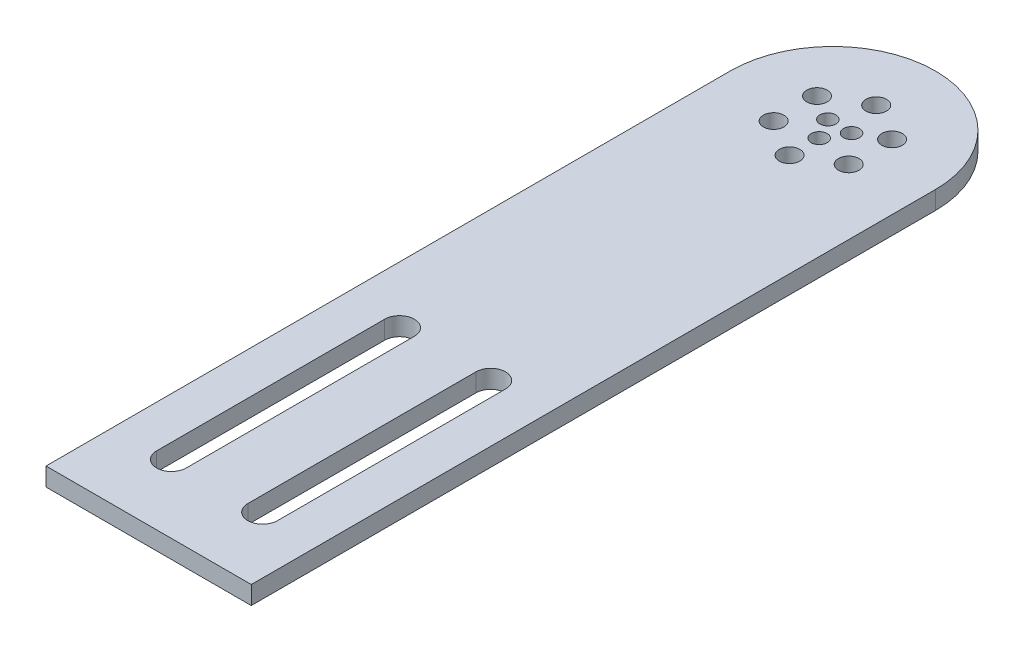
ISO-10303-21;
HEADER;
FILE_DESCRIPTION(('STEP AP214'),'2;1');
FILE_NAME('part.step','',(''),(''),'','','');
FILE_SCHEMA(('AUTOMOTIVE_DESIGN { 1 0 10303 214 1 1 1 1 }'));
ENDSEC;
DATA;
#1=APPLICATION_CONTEXT('core data for automotive mechanical design processes');
#2=APPLICATION_PROTOCOL_DEFINITION('international standard','automotive_design',2000,#1);
#3=PRODUCT_CONTEXT('',#1,'mechanical');
#4=PRODUCT('Part','Part','',(#3));
#5=PRODUCT_RELATED_PRODUCT_CATEGORY('part','',(#4));
#6=PRODUCT_DEFINITION_FORMATION('','',#4);
#7=PRODUCT_DEFINITION_CONTEXT('part definition',#1,'design');
#8=PRODUCT_DEFINITION('design','',#6,#7);
#9=PRODUCT_DEFINITION_SHAPE('','',#8);
#10=(LENGTH_UNIT() NAMED_UNIT(*) SI_UNIT(.MILLI.,.METRE.));
#11=(NAMED_UNIT(*) PLANE_ANGLE_UNIT() SI_UNIT($,.RADIAN.));
#12=(NAMED_UNIT(*) SI_UNIT($,.STERADIAN.) SOLID_ANGLE_UNIT());
#13=UNCERTAINTY_MEASURE_WITH_UNIT(LENGTH_MEASURE(1.E-05),#10,'distance_accuracy_value','');
#14=(GEOMETRIC_REPRESENTATION_CONTEXT(3) GLOBAL_UNCERTAINTY_ASSIGNED_CONTEXT((#13)) GLOBAL_UNIT_ASSIGNED_CONTEXT((#10,
#11,#12)) REPRESENTATION_CONTEXT('',''));
#15=CARTESIAN_POINT('',(0.,0.,0.));
#16=DIRECTION('',(0.,0.,1.));
#17=DIRECTION('',(1.,0.,0.));
#18=AXIS2_PLACEMENT_3D('',#15,#16,#17);
#19=CARTESIAN_POINT('',(0.,4.,0.));
#20=DIRECTION('',(0.,1.,0.));
#21=DIRECTION('',(0.,0.,1.));
#22=AXIS2_PLACEMENT_3D('',#19,#20,#21);
#23=PLANE('',#22);
#24=CARTESIAN_POINT('',(-9.99999999999999,4.,9.99999999999999));
#25=DIRECTION('',(0.,1.,0.));
#26=DIRECTION('',(0.,0.,1.));
#27=AXIS2_PLACEMENT_3D('',#24,#25,#26);
#28=CIRCLE('',#27,3.25);
#29=CARTESIAN_POINT('',(-6.74999999999999,4.,9.99999999999999));
#30=VERTEX_POINT('',#29);
#31=CARTESIAN_POINT('',(-13.25,4.,9.99999999999999));
#32=VERTEX_POINT('',#31);
#33=EDGE_CURVE('E151',#30,#32,#28,.T.);
#34=ORIENTED_EDGE('',*,*,#33,.F.);
#35=DIRECTION('',(0.,0.,-1.));
#36=VECTOR('',#35,1.);
#37=CARTESIAN_POINT('',(-6.74999999999999,4.,9.99999999999999));
#38=LINE('',#37,#36);
#39=CARTESIAN_POINT('',(-6.74999999999998,4.,60.));
#40=VERTEX_POINT('',#39);
#41=EDGE_CURVE('E159',#40,#30,#38,.T.);
#42=ORIENTED_EDGE('',*,*,#41,.F.);
#43=CARTESIAN_POINT('',(-9.99999999999998,4.,60.));
#44=DIRECTION('',(0.,1.,0.));
#45=DIRECTION('',(0.,0.,1.));
#46=AXIS2_PLACEMENT_3D('',#43,#44,#45);
#47=CIRCLE('',#46,3.25);
#48=CARTESIAN_POINT('',(-13.25,4.,60.));
#49=VERTEX_POINT('',#48);
#50=EDGE_CURVE('E173',#49,#40,#47,.T.);
#51=ORIENTED_EDGE('',*,*,#50,.F.);
#52=DIRECTION('',(0.,0.,1.));
#53=VECTOR('',#52,1.);
#54=CARTESIAN_POINT('',(-13.25,4.,9.99999999999999));
#55=LINE('',#54,#53);
#56=EDGE_CURVE('E170',#32,#49,#55,.T.);
#57=ORIENTED_EDGE('',*,*,#56,.F.);
#58=EDGE_LOOP('',(#34,#42,#51,#57));
#59=FACE_BOUND('',#58,.T.);
#60=CARTESIAN_POINT('',(-2.5980762113533,4.,-76.5));
#61=DIRECTION('',(0.,1.,0.));
#62=DIRECTION('',(-0.866025403784436,0.,-0.500000000000004));
#63=AXIS2_PLACEMENT_3D('',#60,#61,#62);
#64=CIRCLE('',#63,1.75);
#65=CARTESIAN_POINT('',(-4.11362066797607,4.,-77.375));
#66=VERTEX_POINT('',#65);
#67=EDGE_CURVE('E191',#66,#66,#64,.T.);
#68=ORIENTED_EDGE('',*,*,#67,.F.);
#69=EDGE_LOOP('',(#68));
#70=FACE_BOUND('',#69,.T.);
#71=CARTESIAN_POINT('',(2.59807621135334,4.,-76.5));
#72=DIRECTION('',(0.,1.,0.));
#73=DIRECTION('',(0.866025403784443,0.,-0.499999999999992));
#74=AXIS2_PLACEMENT_3D('',#71,#72,#73);
#75=CIRCLE('',#74,1.75);
#76=CARTESIAN_POINT('',(4.11362066797612,4.,-77.3749999999999));
#77=VERTEX_POINT('',#76);
#78=EDGE_CURVE('E180',#77,#77,#75,.T.);
#79=ORIENTED_EDGE('',*,*,#78,.F.);
#80=EDGE_LOOP('',(#79));
#81=FACE_BOUND('',#80,.T.);
#82=CARTESIAN_POINT('',(0.,4.,-72.));
#83=DIRECTION('',(0.,1.,0.));
#84=DIRECTION('',(0.,0.,1.));
#85=AXIS2_PLACEMENT_3D('',#82,#83,#84);
#86=CIRCLE('',#85,1.75);
#87=CARTESIAN_POINT('',(0.,4.,-70.25));
#88=VERTEX_POINT('',#87);
#89=EDGE_CURVE('E190',#88,#88,#86,.T.);
#90=ORIENTED_EDGE('',*,*,#89,.F.);
#91=EDGE_LOOP('',(#90));
#92=FACE_BOUND('',#91,.T.);
#93=CARTESIAN_POINT('',(8.22724133595212,4.,-79.7500000000001));
#94=DIRECTION('',(0.,1.,0.));
#95=DIRECTION('',(-0.866025403784433,0.,0.50000000000001));
#96=AXIS2_PLACEMENT_3D('',#93,#94,#95);
#97=CIRCLE('',#96,2.25);
#98=CARTESIAN_POINT('',(6.27868417743715,4.,-78.6250000000001));
#99=VERTEX_POINT('',#98);
#100=EDGE_CURVE('E202',#99,#99,#97,.T.);
#101=ORIENTED_EDGE('',*,*,#100,.F.);
#102=EDGE_LOOP('',(#101));
#103=FACE_BOUND('',#102,.T.);
#104=CARTESIAN_POINT('',(8.22724133595222,4.,-70.2500000000001));
#105=DIRECTION('',(0.,1.,0.));
#106=DIRECTION('',(-0.866025403784443,0.,-0.499999999999992));
#107=AXIS2_PLACEMENT_3D('',#104,#105,#106);
#108=CIRCLE('',#107,2.25);
#109=CARTESIAN_POINT('',(6.27868417743722,4.,-71.3750000000001));
#110=VERTEX_POINT('',#109);
#111=EDGE_CURVE('E221',#110,#110,#108,.T.);
#112=ORIENTED_EDGE('',*,*,#111,.F.);
#113=EDGE_LOOP('',(#112));
#114=FACE_BOUND('',#113,.T.);
#115=CARTESIAN_POINT('',(0.,4.,-65.5));
#116=DIRECTION('',(0.,1.,0.));
#117=DIRECTION('',(0.,0.,-1.));
#118=AXIS2_PLACEMENT_3D('',#115,#116,#117);
#119=CIRCLE('',#118,2.25);
#120=CARTESIAN_POINT('',(0.,4.,-67.75));
#121=VERTEX_POINT('',#120);
#122=EDGE_CURVE('E215',#121,#121,#119,.T.);
#123=ORIENTED_EDGE('',*,*,#122,.F.);
#124=EDGE_LOOP('',(#123));
#125=FACE_BOUND('',#124,.T.);
#126=CARTESIAN_POINT('',(-8.22724133595212,4.,-70.25));
#127=DIRECTION('',(0.,1.,0.));
#128=DIRECTION('',(0.866025403784436,0.,-0.500000000000004));
#129=AXIS2_PLACEMENT_3D('',#126,#127,#128);
#130=CIRCLE('',#129,2.25);
#131=CARTESIAN_POINT('',(-6.27868417743714,4.,-71.375));
#132=VERTEX_POINT('',#131);
#133=EDGE_CURVE('E209',#132,#132,#130,.T.);
#134=ORIENTED_EDGE('',*,*,#133,.F.);
#135=EDGE_LOOP('',(#134));
#136=FACE_BOUND('',#135,.T.);
#137=CARTESIAN_POINT('',(-8.22724133595215,4.,-79.75));
#138=DIRECTION('',(0.,1.,0.));
#139=DIRECTION('',(0.86602540378444,0.,0.499999999999998));
#140=AXIS2_PLACEMENT_3D('',#137,#138,#139);
#141=CIRCLE('',#140,2.25);
#142=CARTESIAN_POINT('',(-6.27868417743716,4.,-78.625));
#143=VERTEX_POINT('',#142);
#144=EDGE_CURVE('E208',#143,#143,#141,.T.);
#145=ORIENTED_EDGE('',*,*,#144,.F.);
#146=EDGE_LOOP('',(#145));
#147=FACE_BOUND('',#146,.T.);
#148=CARTESIAN_POINT('',(0.,4.,-84.5));
#149=DIRECTION('',(0.,1.,0.));
#150=DIRECTION('',(0.,0.,1.));
#151=AXIS2_PLACEMENT_3D('',#148,#149,#150);
#152=CIRCLE('',#151,2.25);
#153=CARTESIAN_POINT('',(0.,4.,-82.25));
#154=VERTEX_POINT('',#153);
#155=EDGE_CURVE('E232',#154,#154,#152,.T.);
#156=ORIENTED_EDGE('',*,*,#155,.F.);
#157=EDGE_LOOP('',(#156));
#158=FACE_BOUND('',#157,.T.);
#159=DIRECTION('',(0.,0.,-1.));
#160=VECTOR('',#159,1.);
#161=CARTESIAN_POINT('',(22.5,4.,-75.));
#162=LINE('',#161,#160);
#163=CARTESIAN_POINT('',(22.5,4.,75.));
#164=VERTEX_POINT('',#163);
#165=CARTESIAN_POINT('',(22.5,4.,-75.));
#166=VERTEX_POINT('',#165);
#167=EDGE_CURVE('E246',#164,#166,#162,.T.);
#168=ORIENTED_EDGE('',*,*,#167,.T.);
#169=CARTESIAN_POINT('',(0.,4.,-75.));
#170=DIRECTION('',(0.,1.,0.));
#171=DIRECTION('',(0.,0.,1.));
#172=AXIS2_PLACEMENT_3D('',#169,#170,#171);
#173=CIRCLE('',#172,22.5);
#174=CARTESIAN_POINT('',(-22.5,4.,-75.));
#175=VERTEX_POINT('',#174);
#176=EDGE_CURVE('E241',#166,#175,#173,.T.);
#177=ORIENTED_EDGE('',*,*,#176,.T.);
#178=DIRECTION('',(0.,0.,1.));
#179=VECTOR('',#178,1.);
#180=CARTESIAN_POINT('',(-22.5,4.,-75.));
#181=LINE('',#180,#179);
#182=CARTESIAN_POINT('',(-22.5,4.,75.));
#183=VERTEX_POINT('',#182);
#184=EDGE_CURVE('E249',#175,#183,#181,.T.);
#185=ORIENTED_EDGE('',*,*,#184,.T.);
#186=DIRECTION('',(1.,0.,0.));
#187=VECTOR('',#186,1.);
#188=CARTESIAN_POINT('',(-22.5,4.,75.));
#189=LINE('',#188,#187);
#190=EDGE_CURVE('E252',#183,#164,#189,.T.);
#191=ORIENTED_EDGE('',*,*,#190,.T.);
#192=EDGE_LOOP('',(#168,#177,#185,#191));
#193=FACE_BOUND('',#192,.T.);
#194=DIRECTION('',(0.,0.,-1.));
#195=VECTOR('',#194,1.);
#196=CARTESIAN_POINT('',(6.74999999999999,4.,9.99999999999999));
#197=LINE('',#196,#195);
#198=CARTESIAN_POINT('',(6.74999999999998,4.,60.));
#199=VERTEX_POINT('',#198);
#200=CARTESIAN_POINT('',(6.74999999999999,4.,9.99999999999999));
#201=VERTEX_POINT('',#200);
#202=EDGE_CURVE('E145',#199,#201,#197,.T.);
#203=ORIENTED_EDGE('',*,*,#202,.T.);
#204=CARTESIAN_POINT('',(9.99999999999999,4.,9.99999999999999));
#205=DIRECTION('',(0.,-1.,0.));
#206=DIRECTION('',(0.,0.,1.));
#207=AXIS2_PLACEMENT_3D('',#204,#205,#206);
#208=CIRCLE('',#207,3.25);
#209=CARTESIAN_POINT('',(13.25,4.,9.99999999999999));
#210=VERTEX_POINT('',#209);
#211=EDGE_CURVE('E47',#201,#210,#208,.T.);
#212=ORIENTED_EDGE('',*,*,#211,.T.);
#213=DIRECTION('',(0.,0.,1.));
#214=VECTOR('',#213,1.);
#215=CARTESIAN_POINT('',(13.25,4.,9.99999999999999));
#216=LINE('',#215,#214);
#217=CARTESIAN_POINT('',(13.25,4.,60.));
#218=VERTEX_POINT('',#217);
#219=EDGE_CURVE('E136',#210,#218,#216,.T.);
#220=ORIENTED_EDGE('',*,*,#219,.T.);
#221=CARTESIAN_POINT('',(9.99999999999998,4.,60.));
#222=DIRECTION('',(0.,-1.,0.));
#223=DIRECTION('',(0.,0.,1.));
#224=AXIS2_PLACEMENT_3D('',#221,#222,#223);
#225=CIRCLE('',#224,3.25);
#226=EDGE_CURVE('E139',#218,#199,#225,.T.);
#227=ORIENTED_EDGE('',*,*,#226,.T.);
#228=EDGE_LOOP('',(#203,#212,#220,#227));
#229=FACE_BOUND('',#228,.T.);
#230=ADVANCED_FACE('F32',(#59,#70,#81,#92,#103,#114,#125,#136,#147,#158,#193,#229),#23,.T.);
#231=CARTESIAN_POINT('',(0.,0.,0.));
#232=DIRECTION('',(0.,1.,0.));
#233=DIRECTION('',(0.,0.,1.));
#234=AXIS2_PLACEMENT_3D('',#231,#232,#233);
#235=PLANE('',#234);
#236=DIRECTION('',(0.,0.,1.));
#237=VECTOR('',#236,1.);
#238=CARTESIAN_POINT('',(-22.5,0.,-75.));
#239=LINE('',#238,#237);
#240=CARTESIAN_POINT('',(-22.5,0.,-75.));
#241=VERTEX_POINT('',#240);
#242=CARTESIAN_POINT('',(-22.5,0.,75.));
#243=VERTEX_POINT('',#242);
#244=EDGE_CURVE('E257',#241,#243,#239,.T.);
#245=ORIENTED_EDGE('',*,*,#244,.F.);
#246=CARTESIAN_POINT('',(0.,0.,-75.));
#247=DIRECTION('',(0.,1.,0.));
#248=DIRECTION('',(0.,0.,1.));
#249=AXIS2_PLACEMENT_3D('',#246,#247,#248);
#250=CIRCLE('',#249,22.5);
#251=CARTESIAN_POINT('',(22.5,0.,-75.));
#252=VERTEX_POINT('',#251);
#253=EDGE_CURVE('E238',#252,#241,#250,.T.);
#254=ORIENTED_EDGE('',*,*,#253,.F.);
#255=DIRECTION('',(0.,0.,-1.));
#256=VECTOR('',#255,1.);
#257=CARTESIAN_POINT('',(22.5,0.,-75.));
#258=LINE('',#257,#256);
#259=CARTESIAN_POINT('',(22.5,0.,75.));
#260=VERTEX_POINT('',#259);
#261=EDGE_CURVE('E244',#260,#252,#258,.T.);
#262=ORIENTED_EDGE('',*,*,#261,.F.);
#263=DIRECTION('',(1.,0.,0.));
#264=VECTOR('',#263,1.);
#265=CARTESIAN_POINT('',(-22.5,0.,75.));
#266=LINE('',#265,#264);
#267=EDGE_CURVE('E250',#243,#260,#266,.T.);
#268=ORIENTED_EDGE('',*,*,#267,.F.);
#269=EDGE_LOOP('',(#245,#254,#262,#268));
#270=FACE_BOUND('',#269,.T.);
#271=CARTESIAN_POINT('',(0.,0.,-84.5));
#272=DIRECTION('',(0.,1.,0.));
#273=DIRECTION('',(0.,0.,1.));
#274=AXIS2_PLACEMENT_3D('',#271,#272,#273);
#275=CIRCLE('',#274,2.25);
#276=CARTESIAN_POINT('',(0.,0.,-82.25));
#277=VERTEX_POINT('',#276);
#278=EDGE_CURVE('E235',#277,#277,#275,.T.);
#279=ORIENTED_EDGE('',*,*,#278,.T.);
#280=EDGE_LOOP('',(#279));
#281=FACE_BOUND('',#280,.T.);
#282=CARTESIAN_POINT('',(-8.22724133595215,0.,-79.75));
#283=DIRECTION('',(0.,1.,0.));
#284=DIRECTION('',(0.86602540378444,0.,0.499999999999998));
#285=AXIS2_PLACEMENT_3D('',#282,#283,#284);
#286=CIRCLE('',#285,2.25);
#287=CARTESIAN_POINT('',(-6.27868417743716,0.,-78.625));
#288=VERTEX_POINT('',#287);
#289=EDGE_CURVE('E229',#288,#288,#286,.T.);
#290=ORIENTED_EDGE('',*,*,#289,.T.);
#291=EDGE_LOOP('',(#290));
#292=FACE_BOUND('',#291,.T.);
#293=CARTESIAN_POINT('',(-8.22724133595212,0.,-70.25));
#294=DIRECTION('',(0.,1.,0.));
#295=DIRECTION('',(0.866025403784436,0.,-0.500000000000004));
#296=AXIS2_PLACEMENT_3D('',#293,#294,#295);
#297=CIRCLE('',#296,2.25);
#298=CARTESIAN_POINT('',(-6.27868417743714,0.,-71.375));
#299=VERTEX_POINT('',#298);
#300=EDGE_CURVE('E205',#299,#299,#297,.T.);
#301=ORIENTED_EDGE('',*,*,#300,.T.);
#302=EDGE_LOOP('',(#301));
#303=FACE_BOUND('',#302,.T.);
#304=CARTESIAN_POINT('',(0.,0.,-65.5));
#305=DIRECTION('',(0.,1.,0.));
#306=DIRECTION('',(0.,0.,-1.));
#307=AXIS2_PLACEMENT_3D('',#304,#305,#306);
#308=CIRCLE('',#307,2.25);
#309=CARTESIAN_POINT('',(0.,0.,-67.75));
#310=VERTEX_POINT('',#309);
#311=EDGE_CURVE('E212',#310,#310,#308,.T.);
#312=ORIENTED_EDGE('',*,*,#311,.T.);
#313=EDGE_LOOP('',(#312));
#314=FACE_BOUND('',#313,.T.);
#315=CARTESIAN_POINT('',(8.22724133595222,0.,-70.2500000000001));
#316=DIRECTION('',(0.,1.,0.));
#317=DIRECTION('',(-0.866025403784443,0.,-0.499999999999992));
#318=AXIS2_PLACEMENT_3D('',#315,#316,#317);
#319=CIRCLE('',#318,2.25);
#320=CARTESIAN_POINT('',(6.27868417743722,0.,-71.3750000000001));
#321=VERTEX_POINT('',#320);
#322=EDGE_CURVE('E218',#321,#321,#319,.T.);
#323=ORIENTED_EDGE('',*,*,#322,.T.);
#324=EDGE_LOOP('',(#323));
#325=FACE_BOUND('',#324,.T.);
#326=CARTESIAN_POINT('',(8.22724133595212,0.,-79.7500000000001));
#327=DIRECTION('',(0.,1.,0.));
#328=DIRECTION('',(-0.866025403784433,0.,0.50000000000001));
#329=AXIS2_PLACEMENT_3D('',#326,#327,#328);
#330=CIRCLE('',#329,2.25);
#331=CARTESIAN_POINT('',(6.27868417743715,0.,-78.6250000000001));
#332=VERTEX_POINT('',#331);
#333=EDGE_CURVE('E224',#332,#332,#330,.T.);
#334=ORIENTED_EDGE('',*,*,#333,.T.);
#335=EDGE_LOOP('',(#334));
#336=FACE_BOUND('',#335,.T.);
#337=CARTESIAN_POINT('',(0.,0.,-72.));
#338=DIRECTION('',(0.,1.,0.));
#339=DIRECTION('',(0.,0.,1.));
#340=AXIS2_PLACEMENT_3D('',#337,#338,#339);
#341=CIRCLE('',#340,1.75);
#342=CARTESIAN_POINT('',(0.,0.,-70.25));
#343=VERTEX_POINT('',#342);
#344=EDGE_CURVE('E199',#343,#343,#341,.T.);
#345=ORIENTED_EDGE('',*,*,#344,.T.);
#346=EDGE_LOOP('',(#345));
#347=FACE_BOUND('',#346,.T.);
#348=CARTESIAN_POINT('',(2.59807621135334,0.,-76.5));
#349=DIRECTION('',(0.,1.,0.));
#350=DIRECTION('',(0.866025403784443,0.,-0.499999999999992));
#351=AXIS2_PLACEMENT_3D('',#348,#349,#350);
#352=CIRCLE('',#351,1.75);
#353=CARTESIAN_POINT('',(4.11362066797612,0.,-77.3749999999999));
#354=VERTEX_POINT('',#353);
#355=EDGE_CURVE('E194',#354,#354,#352,.T.);
#356=ORIENTED_EDGE('',*,*,#355,.T.);
#357=EDGE_LOOP('',(#356));
#358=FACE_BOUND('',#357,.T.);
#359=CARTESIAN_POINT('',(-2.5980762113533,0.,-76.5));
#360=DIRECTION('',(0.,1.,0.));
#361=DIRECTION('',(-0.866025403784436,0.,-0.500000000000004));
#362=AXIS2_PLACEMENT_3D('',#359,#360,#361);
#363=CIRCLE('',#362,1.75);
#364=CARTESIAN_POINT('',(-4.11362066797607,0.,-77.375));
#365=VERTEX_POINT('',#364);
#366=EDGE_CURVE('E187',#365,#365,#363,.T.);
#367=ORIENTED_EDGE('',*,*,#366,.T.);
#368=EDGE_LOOP('',(#367));
#369=FACE_BOUND('',#368,.T.);
#370=DIRECTION('',(0.,0.,-1.));
#371=VECTOR('',#370,1.);
#372=CARTESIAN_POINT('',(-6.74999999999999,0.,9.99999999999999));
#373=LINE('',#372,#371);
#374=CARTESIAN_POINT('',(-6.74999999999998,0.,60.));
#375=VERTEX_POINT('',#374);
#376=CARTESIAN_POINT('',(-6.74999999999999,0.,9.99999999999999));
#377=VERTEX_POINT('',#376);
#378=EDGE_CURVE('E165',#375,#377,#373,.T.);
#379=ORIENTED_EDGE('',*,*,#378,.T.);
#380=CARTESIAN_POINT('',(-9.99999999999999,0.,9.99999999999999));
#381=DIRECTION('',(0.,1.,0.));
#382=DIRECTION('',(0.,0.,1.));
#383=AXIS2_PLACEMENT_3D('',#380,#381,#382);
#384=CIRCLE('',#383,3.25);
#385=CARTESIAN_POINT('',(-13.25,0.,9.99999999999999));
#386=VERTEX_POINT('',#385);
#387=EDGE_CURVE('E155',#377,#386,#384,.T.);
#388=ORIENTED_EDGE('',*,*,#387,.T.);
#389=DIRECTION('',(0.,0.,1.));
#390=VECTOR('',#389,1.);
#391=CARTESIAN_POINT('',(-13.25,0.,9.99999999999999));
#392=LINE('',#391,#390);
#393=CARTESIAN_POINT('',(-13.25,0.,60.));
#394=VERTEX_POINT('',#393);
#395=EDGE_CURVE('E158',#386,#394,#392,.T.);
#396=ORIENTED_EDGE('',*,*,#395,.T.);
#397=CARTESIAN_POINT('',(-9.99999999999998,0.,60.));
#398=DIRECTION('',(0.,1.,0.));
#399=DIRECTION('',(0.,0.,1.));
#400=AXIS2_PLACEMENT_3D('',#397,#398,#399);
#401=CIRCLE('',#400,3.25);
#402=EDGE_CURVE('E162',#394,#375,#401,.T.);
#403=ORIENTED_EDGE('',*,*,#402,.T.);
#404=EDGE_LOOP('',(#379,#388,#396,#403));
#405=FACE_BOUND('',#404,.T.);
#406=CARTESIAN_POINT('',(9.99999999999999,0.,9.99999999999999));
#407=DIRECTION('',(0.,-1.,0.));
#408=DIRECTION('',(0.,0.,1.));
#409=AXIS2_PLACEMENT_3D('',#406,#407,#408);
#410=CIRCLE('',#409,3.25);
#411=CARTESIAN_POINT('',(6.74999999999999,0.,9.99999999999999));
#412=VERTEX_POINT('',#411);
#413=CARTESIAN_POINT('',(13.25,0.,9.99999999999999));
#414=VERTEX_POINT('',#413);
#415=EDGE_CURVE('E128',#412,#414,#410,.T.);
#416=ORIENTED_EDGE('',*,*,#415,.F.);
#417=DIRECTION('',(0.,0.,-1.));
#418=VECTOR('',#417,1.);
#419=CARTESIAN_POINT('',(6.74999999999999,0.,9.99999999999999));
#420=LINE('',#419,#418);
#421=CARTESIAN_POINT('',(6.74999999999998,0.,60.));
#422=VERTEX_POINT('',#421);
#423=EDGE_CURVE('E120',#422,#412,#420,.T.);
#424=ORIENTED_EDGE('',*,*,#423,.F.);
#425=CARTESIAN_POINT('',(9.99999999999998,0.,60.));
#426=DIRECTION('',(0.,-1.,0.));
#427=DIRECTION('',(0.,0.,1.));
#428=AXIS2_PLACEMENT_3D('',#425,#426,#427);
#429=CIRCLE('',#428,3.25);
#430=CARTESIAN_POINT('',(13.25,0.,60.));
#431=VERTEX_POINT('',#430);
#432=EDGE_CURVE('E127',#431,#422,#429,.T.);
#433=ORIENTED_EDGE('',*,*,#432,.F.);
#434=DIRECTION('',(0.,0.,1.));
#435=VECTOR('',#434,1.);
#436=CARTESIAN_POINT('',(13.25,0.,9.99999999999999));
#437=LINE('',#436,#435);
#438=EDGE_CURVE('E132',#414,#431,#437,.T.);
#439=ORIENTED_EDGE('',*,*,#438,.F.);
#440=EDGE_LOOP('',(#416,#424,#433,#439));
#441=FACE_BOUND('',#440,.T.);
#442=ADVANCED_FACE('F135',(#270,#281,#292,#303,#314,#325,#336,#347,#358,#369,#405,#441),#235,.F.);
#443=CARTESIAN_POINT('',(22.5,4.,-75.));
#444=DIRECTION('',(-1.,0.,0.));
#445=DIRECTION('',(0.,0.,1.));
#446=AXIS2_PLACEMENT_3D('',#443,#444,#445);
#447=PLANE('',#446);
#448=ORIENTED_EDGE('',*,*,#261,.T.);
#449=DIRECTION('',(0.,-1.,0.));
#450=VECTOR('',#449,1.);
#451=CARTESIAN_POINT('',(22.5,4.,-75.));
#452=LINE('',#451,#450);
#453=EDGE_CURVE('E11',#166,#252,#452,.T.);
#454=ORIENTED_EDGE('',*,*,#453,.F.);
#455=ORIENTED_EDGE('',*,*,#167,.F.);
#456=DIRECTION('',(0.,-1.,0.));
#457=VECTOR('',#456,1.);
#458=CARTESIAN_POINT('',(22.5,4.,75.));
#459=LINE('',#458,#457);
#460=EDGE_CURVE('E254',#164,#260,#459,.T.);
#461=ORIENTED_EDGE('',*,*,#460,.T.);
#462=EDGE_LOOP('',(#448,#454,#455,#461));
#463=FACE_BOUND('',#462,.T.);
#464=ADVANCED_FACE('F34',(#463),#447,.F.);
#465=CARTESIAN_POINT('',(-22.5,4.,-75.));
#466=DIRECTION('',(1.,0.,0.));
#467=DIRECTION('',(0.,0.,-1.));
#468=AXIS2_PLACEMENT_3D('',#465,#466,#467);
#469=PLANE('',#468);
#470=ORIENTED_EDGE('',*,*,#244,.T.);
#471=DIRECTION('',(0.,-1.,0.));
#472=VECTOR('',#471,1.);
#473=CARTESIAN_POINT('',(-22.5,4.,75.));
#474=LINE('',#473,#472);
#475=EDGE_CURVE('E262',#183,#243,#474,.T.);
#476=ORIENTED_EDGE('',*,*,#475,.F.);
#477=ORIENTED_EDGE('',*,*,#184,.F.);
#478=DIRECTION('',(0.,-1.,0.));
#479=VECTOR('',#478,1.);
#480=CARTESIAN_POINT('',(-22.5,4.,-75.));
#481=LINE('',#480,#479);
#482=EDGE_CURVE('E40',#175,#241,#481,.T.);
#483=ORIENTED_EDGE('',*,*,#482,.T.);
#484=EDGE_LOOP('',(#470,#476,#477,#483));
#485=FACE_BOUND('',#484,.T.);
#486=ADVANCED_FACE('F268',(#485),#469,.F.);
#487=CARTESIAN_POINT('',(-22.5,4.,75.));
#488=DIRECTION('',(0.,0.,-1.));
#489=DIRECTION('',(-1.,0.,0.));
#490=AXIS2_PLACEMENT_3D('',#487,#488,#489);
#491=PLANE('',#490);
#492=ORIENTED_EDGE('',*,*,#267,.T.);
#493=ORIENTED_EDGE('',*,*,#460,.F.);
#494=ORIENTED_EDGE('',*,*,#190,.F.);
#495=ORIENTED_EDGE('',*,*,#475,.T.);
#496=EDGE_LOOP('',(#492,#493,#494,#495));
#497=FACE_BOUND('',#496,.T.);
#498=ADVANCED_FACE('F278',(#497),#491,.F.);
#499=CARTESIAN_POINT('',(0.,4.,-75.));
#500=DIRECTION('',(0.,-1.,0.));
#501=DIRECTION('',(0.,0.,-1.));
#502=AXIS2_PLACEMENT_3D('',#499,#500,#501);
#503=CYLINDRICAL_SURFACE('',#502,22.5);
#504=ORIENTED_EDGE('',*,*,#176,.F.);
#505=ORIENTED_EDGE('',*,*,#453,.T.);
#506=ORIENTED_EDGE('',*,*,#253,.T.);
#507=ORIENTED_EDGE('',*,*,#482,.F.);
#508=EDGE_LOOP('',(#504,#505,#506,#507));
#509=FACE_BOUND('',#508,.T.);
#510=ADVANCED_FACE('F285',(#509),#503,.T.);
#511=CARTESIAN_POINT('',(0.,0.,-84.5));
#512=DIRECTION('',(0.,1.,0.));
#513=DIRECTION('',(0.,0.,1.));
#514=AXIS2_PLACEMENT_3D('',#511,#512,#513);
#515=CYLINDRICAL_SURFACE('',#514,2.25);
#516=ORIENTED_EDGE('',*,*,#278,.F.);
#517=EDGE_LOOP('',(#516));
#518=FACE_BOUND('',#517,.T.);
#519=ORIENTED_EDGE('',*,*,#155,.T.);
#520=EDGE_LOOP('',(#519));
#521=FACE_BOUND('',#520,.T.);
#522=ADVANCED_FACE('F287',(#518,#521),#515,.F.);
#523=CARTESIAN_POINT('',(-8.22724133595215,0.,-79.75));
#524=DIRECTION('',(0.,1.,0.));
#525=DIRECTION('',(0.,0.,1.));
#526=AXIS2_PLACEMENT_3D('',#523,#524,#525);
#527=CYLINDRICAL_SURFACE('',#526,2.25);
#528=ORIENTED_EDGE('',*,*,#289,.F.);
#529=EDGE_LOOP('',(#528));
#530=FACE_BOUND('',#529,.T.);
#531=ORIENTED_EDGE('',*,*,#144,.T.);
#532=EDGE_LOOP('',(#531));
#533=FACE_BOUND('',#532,.T.);
#534=ADVANCED_FACE('F293',(#530,#533),#527,.F.);
#535=CARTESIAN_POINT('',(-8.22724133595212,0.,-70.25));
#536=DIRECTION('',(0.,1.,0.));
#537=DIRECTION('',(0.,0.,1.));
#538=AXIS2_PLACEMENT_3D('',#535,#536,#537);
#539=CYLINDRICAL_SURFACE('',#538,2.25);
#540=ORIENTED_EDGE('',*,*,#300,.F.);
#541=EDGE_LOOP('',(#540));
#542=FACE_BOUND('',#541,.T.);
#543=ORIENTED_EDGE('',*,*,#133,.T.);
#544=EDGE_LOOP('',(#543));
#545=FACE_BOUND('',#544,.T.);
#546=ADVANCED_FACE('F392',(#542,#545),#539,.F.);
#547=CARTESIAN_POINT('',(0.,0.,-65.5));
#548=DIRECTION('',(0.,1.,0.));
#549=DIRECTION('',(0.,0.,1.));
#550=AXIS2_PLACEMENT_3D('',#547,#548,#549);
#551=CYLINDRICAL_SURFACE('',#550,2.25);
#552=ORIENTED_EDGE('',*,*,#311,.F.);
#553=EDGE_LOOP('',(#552));
#554=FACE_BOUND('',#553,.T.);
#555=ORIENTED_EDGE('',*,*,#122,.T.);
#556=EDGE_LOOP('',(#555));
#557=FACE_BOUND('',#556,.T.);
#558=ADVANCED_FACE('F395',(#554,#557),#551,.F.);
#559=CARTESIAN_POINT('',(8.22724133595222,0.,-70.2500000000001));
#560=DIRECTION('',(0.,1.,0.));
#561=DIRECTION('',(0.,0.,1.));
#562=AXIS2_PLACEMENT_3D('',#559,#560,#561);
#563=CYLINDRICAL_SURFACE('',#562,2.25);
#564=ORIENTED_EDGE('',*,*,#322,.F.);
#565=EDGE_LOOP('',(#564));
#566=FACE_BOUND('',#565,.T.);
#567=ORIENTED_EDGE('',*,*,#111,.T.);
#568=EDGE_LOOP('',(#567));
#569=FACE_BOUND('',#568,.T.);
#570=ADVANCED_FACE('F399',(#566,#569),#563,.F.);
#571=CARTESIAN_POINT('',(8.22724133595212,0.,-79.7500000000001));
#572=DIRECTION('',(0.,1.,0.));
#573=DIRECTION('',(0.,0.,1.));
#574=AXIS2_PLACEMENT_3D('',#571,#572,#573);
#575=CYLINDRICAL_SURFACE('',#574,2.25);
#576=ORIENTED_EDGE('',*,*,#333,.F.);
#577=EDGE_LOOP('',(#576));
#578=FACE_BOUND('',#577,.T.);
#579=ORIENTED_EDGE('',*,*,#100,.T.);
#580=EDGE_LOOP('',(#579));
#581=FACE_BOUND('',#580,.T.);
#582=ADVANCED_FACE('F390',(#578,#581),#575,.F.);
#583=CARTESIAN_POINT('',(0.,0.,-72.));
#584=DIRECTION('',(0.,1.,0.));
#585=DIRECTION('',(0.,0.,1.));
#586=AXIS2_PLACEMENT_3D('',#583,#584,#585);
#587=CYLINDRICAL_SURFACE('',#586,1.75);
#588=ORIENTED_EDGE('',*,*,#344,.F.);
#589=EDGE_LOOP('',(#588));
#590=FACE_BOUND('',#589,.T.);
#591=ORIENTED_EDGE('',*,*,#89,.T.);
#592=EDGE_LOOP('',(#591));
#593=FACE_BOUND('',#592,.T.);
#594=ADVANCED_FACE('F386',(#590,#593),#587,.F.);
#595=CARTESIAN_POINT('',(2.59807621135334,0.,-76.5));
#596=DIRECTION('',(0.,1.,0.));
#597=DIRECTION('',(0.,0.,1.));
#598=AXIS2_PLACEMENT_3D('',#595,#596,#597);
#599=CYLINDRICAL_SURFACE('',#598,1.75);
#600=ORIENTED_EDGE('',*,*,#355,.F.);
#601=EDGE_LOOP('',(#600));
#602=FACE_BOUND('',#601,.T.);
#603=ORIENTED_EDGE('',*,*,#78,.T.);
#604=EDGE_LOOP('',(#603));
#605=FACE_BOUND('',#604,.T.);
#606=ADVANCED_FACE('F382',(#602,#605),#599,.F.);
#607=CARTESIAN_POINT('',(-2.5980762113533,0.,-76.5));
#608=DIRECTION('',(0.,1.,0.));
#609=DIRECTION('',(0.,0.,1.));
#610=AXIS2_PLACEMENT_3D('',#607,#608,#609);
#611=CYLINDRICAL_SURFACE('',#610,1.75);
#612=ORIENTED_EDGE('',*,*,#366,.F.);
#613=EDGE_LOOP('',(#612));
#614=FACE_BOUND('',#613,.T.);
#615=ORIENTED_EDGE('',*,*,#67,.T.);
#616=EDGE_LOOP('',(#615));
#617=FACE_BOUND('',#616,.T.);
#618=ADVANCED_FACE('F378',(#614,#617),#611,.F.);
#619=CARTESIAN_POINT('',(-9.99999999999999,0.,9.99999999999999));
#620=DIRECTION('',(0.,1.,0.));
#621=DIRECTION('',(0.,0.,1.));
#622=AXIS2_PLACEMENT_3D('',#619,#620,#621);
#623=CYLINDRICAL_SURFACE('',#622,3.25);
#624=ORIENTED_EDGE('',*,*,#33,.T.);
#625=DIRECTION('',(0.,1.,0.));
#626=VECTOR('',#625,1.);
#627=CARTESIAN_POINT('',(-13.25,0.,9.99999999999999));
#628=LINE('',#627,#626);
#629=EDGE_CURVE('E168',#386,#32,#628,.T.);
#630=ORIENTED_EDGE('',*,*,#629,.F.);
#631=ORIENTED_EDGE('',*,*,#387,.F.);
#632=DIRECTION('',(0.,1.,0.));
#633=VECTOR('',#632,1.);
#634=CARTESIAN_POINT('',(-6.74999999999999,0.,9.99999999999999));
#635=LINE('',#634,#633);
#636=EDGE_CURVE('E178',#377,#30,#635,.T.);
#637=ORIENTED_EDGE('',*,*,#636,.T.);
#638=EDGE_LOOP('',(#624,#630,#631,#637));
#639=FACE_BOUND('',#638,.T.);
#640=ADVANCED_FACE('F369',(#639),#623,.F.);
#641=CARTESIAN_POINT('',(-6.74999999999999,0.,9.99999999999999));
#642=DIRECTION('',(1.,0.,0.));
#643=DIRECTION('',(0.,0.,-1.));
#644=AXIS2_PLACEMENT_3D('',#641,#642,#643);
#645=PLANE('',#644);
#646=ORIENTED_EDGE('',*,*,#41,.T.);
#647=ORIENTED_EDGE('',*,*,#636,.F.);
#648=ORIENTED_EDGE('',*,*,#378,.F.);
#649=DIRECTION('',(0.,1.,0.));
#650=VECTOR('',#649,1.);
#651=CARTESIAN_POINT('',(-6.74999999999998,0.,60.));
#652=LINE('',#651,#650);
#653=EDGE_CURVE('E181',#375,#40,#652,.T.);
#654=ORIENTED_EDGE('',*,*,#653,.T.);
#655=EDGE_LOOP('',(#646,#647,#648,#654));
#656=FACE_BOUND('',#655,.T.);
#657=ADVANCED_FACE('F365',(#656),#645,.F.);
#658=CARTESIAN_POINT('',(-9.99999999999998,0.,60.));
#659=DIRECTION('',(0.,1.,0.));
#660=DIRECTION('',(0.,0.,1.));
#661=AXIS2_PLACEMENT_3D('',#658,#659,#660);
#662=CYLINDRICAL_SURFACE('',#661,3.25);
#663=ORIENTED_EDGE('',*,*,#50,.T.);
#664=ORIENTED_EDGE('',*,*,#653,.F.);
#665=ORIENTED_EDGE('',*,*,#402,.F.);
#666=DIRECTION('',(0.,1.,0.));
#667=VECTOR('',#666,1.);
#668=CARTESIAN_POINT('',(-13.25,0.,60.));
#669=LINE('',#668,#667);
#670=EDGE_CURVE('E183',#394,#49,#669,.T.);
#671=ORIENTED_EDGE('',*,*,#670,.T.);
#672=EDGE_LOOP('',(#663,#664,#665,#671));
#673=FACE_BOUND('',#672,.T.);
#674=ADVANCED_FACE('F368',(#673),#662,.F.);
#675=CARTESIAN_POINT('',(-13.25,0.,9.99999999999999));
#676=DIRECTION('',(-1.,0.,0.));
#677=DIRECTION('',(0.,0.,1.));
#678=AXIS2_PLACEMENT_3D('',#675,#676,#677);
#679=PLANE('',#678);
#680=ORIENTED_EDGE('',*,*,#56,.T.);
#681=ORIENTED_EDGE('',*,*,#670,.F.);
#682=ORIENTED_EDGE('',*,*,#395,.F.);
#683=ORIENTED_EDGE('',*,*,#629,.T.);
#684=EDGE_LOOP('',(#680,#681,#682,#683));
#685=FACE_BOUND('',#684,.T.);
#686=ADVANCED_FACE('F332',(#685),#679,.F.);
#687=CARTESIAN_POINT('',(9.99999999999999,0.,9.99999999999999));
#688=DIRECTION('',(0.,1.,0.));
#689=DIRECTION('',(0.,0.,1.));
#690=AXIS2_PLACEMENT_3D('',#687,#688,#689);
#691=CYLINDRICAL_SURFACE('',#690,3.25);
#692=ORIENTED_EDGE('',*,*,#211,.F.);
#693=DIRECTION('',(0.,1.,0.));
#694=VECTOR('',#693,1.);
#695=CARTESIAN_POINT('',(6.74999999999999,0.,9.99999999999999));
#696=LINE('',#695,#694);
#697=EDGE_CURVE('E122',#412,#201,#696,.T.);
#698=ORIENTED_EDGE('',*,*,#697,.F.);
#699=ORIENTED_EDGE('',*,*,#415,.T.);
#700=DIRECTION('',(0.,1.,0.));
#701=VECTOR('',#700,1.);
#702=CARTESIAN_POINT('',(13.25,0.,9.99999999999999));
#703=LINE('',#702,#701);
#704=EDGE_CURVE('E149',#414,#210,#703,.T.);
#705=ORIENTED_EDGE('',*,*,#704,.T.);
#706=EDGE_LOOP('',(#692,#698,#699,#705));
#707=FACE_BOUND('',#706,.T.);
#708=ADVANCED_FACE('F130',(#707),#691,.F.);
#709=CARTESIAN_POINT('',(13.25,0.,9.99999999999999));
#710=DIRECTION('',(-1.,0.,0.));
#711=DIRECTION('',(0.,0.,1.));
#712=AXIS2_PLACEMENT_3D('',#709,#710,#711);
#713=PLANE('',#712);
#714=ORIENTED_EDGE('',*,*,#219,.F.);
#715=ORIENTED_EDGE('',*,*,#704,.F.);
#716=ORIENTED_EDGE('',*,*,#438,.T.);
#717=DIRECTION('',(0.,1.,0.));
#718=VECTOR('',#717,1.);
#719=CARTESIAN_POINT('',(13.25,0.,60.));
#720=LINE('',#719,#718);
#721=EDGE_CURVE('E152',#431,#218,#720,.T.);
#722=ORIENTED_EDGE('',*,*,#721,.T.);
#723=EDGE_LOOP('',(#714,#715,#716,#722));
#724=FACE_BOUND('',#723,.T.);
#725=ADVANCED_FACE('F331',(#724),#713,.T.);
#726=CARTESIAN_POINT('',(9.99999999999998,0.,60.));
#727=DIRECTION('',(0.,1.,0.));
#728=DIRECTION('',(0.,0.,1.));
#729=AXIS2_PLACEMENT_3D('',#726,#727,#728);
#730=CYLINDRICAL_SURFACE('',#729,3.25);
#731=ORIENTED_EDGE('',*,*,#226,.F.);
#732=ORIENTED_EDGE('',*,*,#721,.F.);
#733=ORIENTED_EDGE('',*,*,#432,.T.);
#734=DIRECTION('',(0.,1.,0.));
#735=VECTOR('',#734,1.);
#736=CARTESIAN_POINT('',(6.74999999999998,0.,60.));
#737=LINE('',#736,#735);
#738=EDGE_CURVE('E55',#422,#199,#737,.T.);
#739=ORIENTED_EDGE('',*,*,#738,.T.);
#740=EDGE_LOOP('',(#731,#732,#733,#739));
#741=FACE_BOUND('',#740,.T.);
#742=ADVANCED_FACE('F342',(#741),#730,.F.);
#743=CARTESIAN_POINT('',(6.74999999999999,0.,9.99999999999999));
#744=DIRECTION('',(1.,0.,0.));
#745=DIRECTION('',(0.,0.,-1.));
#746=AXIS2_PLACEMENT_3D('',#743,#744,#745);
#747=PLANE('',#746);
#748=ORIENTED_EDGE('',*,*,#202,.F.);
#749=ORIENTED_EDGE('',*,*,#738,.F.);
#750=ORIENTED_EDGE('',*,*,#423,.T.);
#751=ORIENTED_EDGE('',*,*,#697,.T.);
#752=EDGE_LOOP('',(#748,#749,#750,#751));
#753=FACE_BOUND('',#752,.T.);
#754=ADVANCED_FACE('F121',(#753),#747,.T.);
#755=CLOSED_SHELL('',(#230,#442,#464,#486,#498,#510,#522,#534,#546,#558,#570,#582,#594,#606,
#618,#640,#657,#674,#686,#708,#725,#742,#754));
#756=MANIFOLD_SOLID_BREP('B2',#755);
#757=ADVANCED_BREP_SHAPE_REPRESENTATION('',(#18,#756),#14);
#758=SHAPE_DEFINITION_REPRESENTATION(#9,#757);
ENDSEC;
END-ISO-10303-21;
